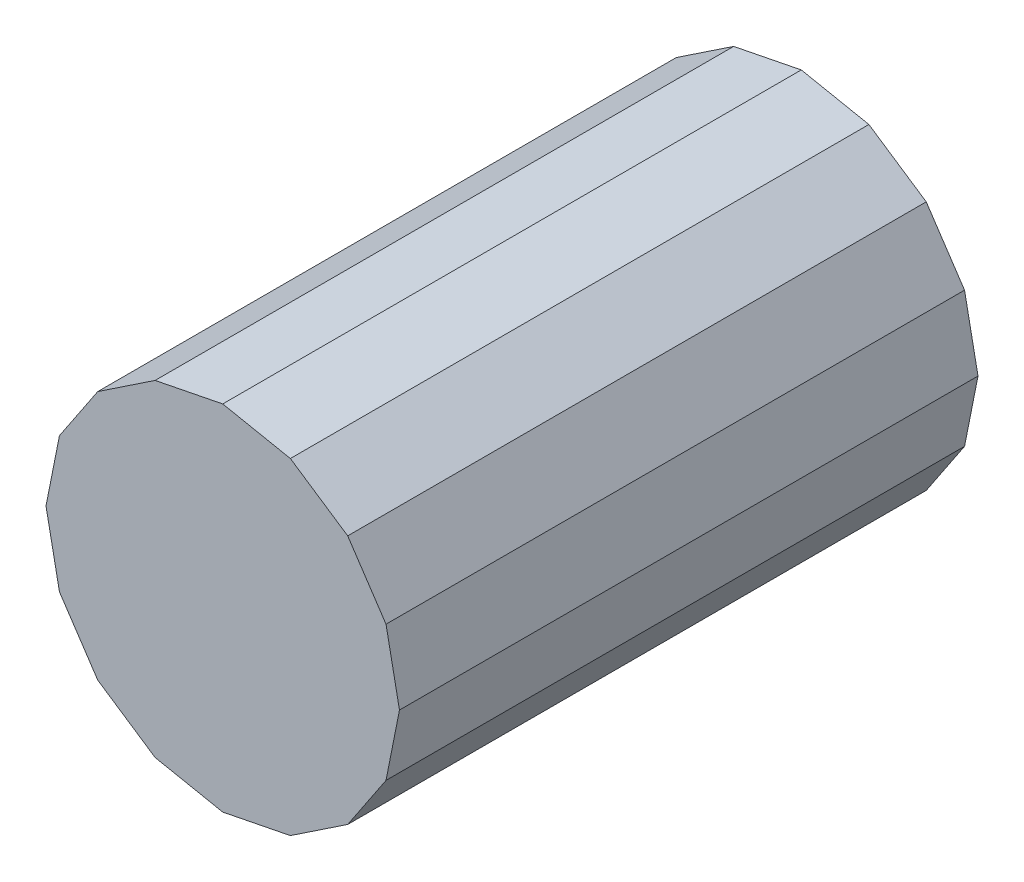
ISO-10303-21;
HEADER;
FILE_DESCRIPTION(('STEP AP214'),'2;1');
FILE_NAME('part.step','',(''),(''),'','','');
FILE_SCHEMA(('AUTOMOTIVE_DESIGN { 1 0 10303 214 1 1 1 1 }'));
ENDSEC;
DATA;
#1=APPLICATION_CONTEXT('core data for automotive mechanical design processes');
#2=APPLICATION_PROTOCOL_DEFINITION('international standard','automotive_design',2000,#1);
#3=PRODUCT_CONTEXT('',#1,'mechanical');
#4=PRODUCT('Part','Part','',(#3));
#5=PRODUCT_RELATED_PRODUCT_CATEGORY('part','',(#4));
#6=PRODUCT_DEFINITION_FORMATION('','',#4);
#7=PRODUCT_DEFINITION_CONTEXT('part definition',#1,'design');
#8=PRODUCT_DEFINITION('design','',#6,#7);
#9=PRODUCT_DEFINITION_SHAPE('','',#8);
#10=(LENGTH_UNIT() NAMED_UNIT(*) SI_UNIT(.MILLI.,.METRE.));
#11=(NAMED_UNIT(*) PLANE_ANGLE_UNIT() SI_UNIT($,.RADIAN.));
#12=(NAMED_UNIT(*) SI_UNIT($,.STERADIAN.) SOLID_ANGLE_UNIT());
#13=UNCERTAINTY_MEASURE_WITH_UNIT(LENGTH_MEASURE(1.E-05),#10,'distance_accuracy_value','');
#14=(GEOMETRIC_REPRESENTATION_CONTEXT(3) GLOBAL_UNCERTAINTY_ASSIGNED_CONTEXT((#13)) GLOBAL_UNIT_ASSIGNED_CONTEXT((#10,
#11,#12)) REPRESENTATION_CONTEXT('',''));
#15=CARTESIAN_POINT('',(0.,0.,0.));
#16=DIRECTION('',(0.,0.,1.));
#17=DIRECTION('',(1.,0.,0.));
#18=AXIS2_PLACEMENT_3D('',#15,#16,#17);
#19=CARTESIAN_POINT('',(-7.63328928000013,8.2750025,1.3499998));
#20=DIRECTION('',(0.,0.,1.));
#21=DIRECTION('',(1.,0.,0.));
#22=AXIS2_PLACEMENT_3D('',#19,#20,#21);
#23=PLANE('',#22);
#24=DIRECTION('',(0.555576860232964,0.831465184101945,0.));
#25=VECTOR('',#24,1.);
#26=CARTESIAN_POINT('',(-7.61933706000013,8.34514714,1.3499998));
#27=LINE('',#26,#25);
#28=CARTESIAN_POINT('',(-7.61933706000013,8.34514714,1.3499998));
#29=VERTEX_POINT('',#28);
#30=CARTESIAN_POINT('',(-7.57960384000013,8.40461108,1.3499998));
#31=VERTEX_POINT('',#30);
#32=EDGE_CURVE('E196',#29,#31,#27,.T.);
#33=ORIENTED_EDGE('',*,*,#32,.T.);
#34=DIRECTION('',(0.831465184101945,0.555576860232964,0.));
#35=VECTOR('',#34,1.);
#36=CARTESIAN_POINT('',(-7.57960384000013,8.40461108,1.3499998));
#37=LINE('',#36,#35);
#38=CARTESIAN_POINT('',(-7.52013990000013,8.4443443,1.3499998));
#39=VERTEX_POINT('',#38);
#40=EDGE_CURVE('E192',#31,#39,#37,.T.);
#41=ORIENTED_EDGE('',*,*,#40,.T.);
#42=DIRECTION('',(0.980786394429767,0.195084721342954,0.));
#43=VECTOR('',#42,1.);
#44=CARTESIAN_POINT('',(-7.52013990000013,8.4443443,1.3499998));
#45=LINE('',#44,#43);
#46=CARTESIAN_POINT('',(-7.44999526000013,8.45829652,1.3499998));
#47=VERTEX_POINT('',#46);
#48=EDGE_CURVE('E188',#39,#47,#45,.T.);
#49=ORIENTED_EDGE('',*,*,#48,.T.);
#50=DIRECTION('',(0.980786394429767,-0.195084721342954,0.));
#51=VECTOR('',#50,1.);
#52=CARTESIAN_POINT('',(-7.44999526000013,8.45829652,1.3499998));
#53=LINE('',#52,#51);
#54=CARTESIAN_POINT('',(-7.37985062000013,8.4443443,1.3499998));
#55=VERTEX_POINT('',#54);
#56=EDGE_CURVE('E184',#47,#55,#53,.T.);
#57=ORIENTED_EDGE('',*,*,#56,.T.);
#58=DIRECTION('',(0.831465184101945,-0.555576860232964,0.));
#59=VECTOR('',#58,1.);
#60=CARTESIAN_POINT('',(-7.37985062000013,8.4443443,1.3499998));
#61=LINE('',#60,#59);
#62=CARTESIAN_POINT('',(-7.32038668000013,8.40461108,1.3499998));
#63=VERTEX_POINT('',#62);
#64=EDGE_CURVE('E180',#55,#63,#61,.T.);
#65=ORIENTED_EDGE('',*,*,#64,.T.);
#66=DIRECTION('',(0.555576860232964,-0.831465184101945,0.));
#67=VECTOR('',#66,1.);
#68=CARTESIAN_POINT('',(-7.32038668000013,8.40461108,1.3499998));
#69=LINE('',#68,#67);
#70=CARTESIAN_POINT('',(-7.28065346000013,8.34514714,1.3499998));
#71=VERTEX_POINT('',#70);
#72=EDGE_CURVE('E176',#63,#71,#69,.T.);
#73=ORIENTED_EDGE('',*,*,#72,.T.);
#74=DIRECTION('',(0.195084721342954,-0.980786394429767,0.));
#75=VECTOR('',#74,1.);
#76=CARTESIAN_POINT('',(-7.28065346000013,8.34514714,1.3499998));
#77=LINE('',#76,#75);
#78=CARTESIAN_POINT('',(-7.26670124000013,8.2750025,1.3499998));
#79=VERTEX_POINT('',#78);
#80=EDGE_CURVE('E172',#71,#79,#77,.T.);
#81=ORIENTED_EDGE('',*,*,#80,.T.);
#82=DIRECTION('',(-0.195084721342954,-0.980786394429767,0.));
#83=VECTOR('',#82,1.);
#84=CARTESIAN_POINT('',(-7.26670124000013,8.2750025,1.3499998));
#85=LINE('',#84,#83);
#86=CARTESIAN_POINT('',(-7.28065346000013,8.20485786,1.3499998));
#87=VERTEX_POINT('',#86);
#88=EDGE_CURVE('E168',#79,#87,#85,.T.);
#89=ORIENTED_EDGE('',*,*,#88,.T.);
#90=DIRECTION('',(-0.555576860232964,-0.831465184101945,0.));
#91=VECTOR('',#90,1.);
#92=CARTESIAN_POINT('',(-7.28065346000013,8.20485786,1.3499998));
#93=LINE('',#92,#91);
#94=CARTESIAN_POINT('',(-7.32038668000013,8.14539392,1.3499998));
#95=VERTEX_POINT('',#94);
#96=EDGE_CURVE('E164',#87,#95,#93,.T.);
#97=ORIENTED_EDGE('',*,*,#96,.T.);
#98=DIRECTION('',(-0.831465184101945,-0.555576860232964,0.));
#99=VECTOR('',#98,1.);
#100=CARTESIAN_POINT('',(-7.32038668000013,8.14539392,1.3499998));
#101=LINE('',#100,#99);
#102=CARTESIAN_POINT('',(-7.37985062000013,8.1056607,1.3499998));
#103=VERTEX_POINT('',#102);
#104=EDGE_CURVE('E160',#95,#103,#101,.T.);
#105=ORIENTED_EDGE('',*,*,#104,.T.);
#106=DIRECTION('',(-0.980786394429767,-0.195084721342954,0.));
#107=VECTOR('',#106,1.);
#108=CARTESIAN_POINT('',(-7.37985062000013,8.1056607,1.3499998));
#109=LINE('',#108,#107);
#110=CARTESIAN_POINT('',(-7.44999526000013,8.09170848,1.3499998));
#111=VERTEX_POINT('',#110);
#112=EDGE_CURVE('E156',#103,#111,#109,.T.);
#113=ORIENTED_EDGE('',*,*,#112,.T.);
#114=DIRECTION('',(-0.980786394429767,0.195084721342954,0.));
#115=VECTOR('',#114,1.);
#116=CARTESIAN_POINT('',(-7.44999526000013,8.09170848,1.3499998));
#117=LINE('',#116,#115);
#118=CARTESIAN_POINT('',(-7.52013990000013,8.1056607,1.3499998));
#119=VERTEX_POINT('',#118);
#120=EDGE_CURVE('E152',#111,#119,#117,.T.);
#121=ORIENTED_EDGE('',*,*,#120,.T.);
#122=DIRECTION('',(-0.831465184101945,0.555576860232964,0.));
#123=VECTOR('',#122,1.);
#124=CARTESIAN_POINT('',(-7.52013990000013,8.1056607,1.3499998));
#125=LINE('',#124,#123);
#126=CARTESIAN_POINT('',(-7.57960384000013,8.14539392,1.3499998));
#127=VERTEX_POINT('',#126);
#128=EDGE_CURVE('E128',#119,#127,#125,.T.);
#129=ORIENTED_EDGE('',*,*,#128,.T.);
#130=DIRECTION('',(-0.555576860232964,0.831465184101945,0.));
#131=VECTOR('',#130,1.);
#132=CARTESIAN_POINT('',(-7.57960384000013,8.14539392,1.3499998));
#133=LINE('',#132,#131);
#134=CARTESIAN_POINT('',(-7.61933706000013,8.20485786,1.3499998));
#135=VERTEX_POINT('',#134);
#136=EDGE_CURVE('E130',#127,#135,#133,.T.);
#137=ORIENTED_EDGE('',*,*,#136,.T.);
#138=DIRECTION('',(-0.195084721342954,0.980786394429767,0.));
#139=VECTOR('',#138,1.);
#140=CARTESIAN_POINT('',(-7.61933706000013,8.20485786,1.3499998));
#141=LINE('',#140,#139);
#142=CARTESIAN_POINT('',(-7.63328928000014,8.2750025,1.3499998));
#143=VERTEX_POINT('',#142);
#144=EDGE_CURVE('E20',#135,#143,#141,.T.);
#145=ORIENTED_EDGE('',*,*,#144,.T.);
#146=DIRECTION('',(0.195084721342954,0.980786394429767,0.));
#147=VECTOR('',#146,1.);
#148=CARTESIAN_POINT('',(-7.63328928000013,8.2750025,1.3499998));
#149=LINE('',#148,#147);
#150=EDGE_CURVE('E201',#143,#29,#149,.T.);
#151=ORIENTED_EDGE('',*,*,#150,.T.);
#152=EDGE_LOOP('',(#33,#41,#49,#57,#65,#73,#81,#89,#97,#105,#113,#121,#129,#137,#145,#151));
#153=FACE_BOUND('',#152,.T.);
#154=ADVANCED_FACE('F17',(#153),#23,.F.);
#155=CARTESIAN_POINT('',(-7.61933706000013,8.20485786,1.95000114));
#156=DIRECTION('',(0.980786394429767,0.195084721342954,0.));
#157=DIRECTION('',(-0.195084721342954,0.980786394429767,0.));
#158=AXIS2_PLACEMENT_3D('',#155,#156,#157);
#159=PLANE('',#158);
#160=DIRECTION('',(0.,0.,1.));
#161=VECTOR('',#160,1.);
#162=CARTESIAN_POINT('',(-7.63328928000013,8.2750025,1.95000114));
#163=LINE('',#162,#161);
#164=CARTESIAN_POINT('',(-7.63328928000014,8.2750025,1.95000114));
#165=VERTEX_POINT('',#164);
#166=EDGE_CURVE('E141',#165,#143,#163,.F.);
#167=ORIENTED_EDGE('',*,*,#166,.T.);
#168=ORIENTED_EDGE('',*,*,#144,.F.);
#169=DIRECTION('',(0.,0.,1.));
#170=VECTOR('',#169,1.);
#171=CARTESIAN_POINT('',(-7.61933706000015,8.20485785999999,1.95000114));
#172=LINE('',#171,#170);
#173=CARTESIAN_POINT('',(-7.61933706000013,8.20485786,1.95000114));
#174=VERTEX_POINT('',#173);
#175=EDGE_CURVE('E136',#135,#174,#172,.T.);
#176=ORIENTED_EDGE('',*,*,#175,.T.);
#177=DIRECTION('',(0.195084721342811,-0.980786394429795,0.));
#178=VECTOR('',#177,1.);
#179=CARTESIAN_POINT('',(-7.63328928000013,8.2750025,1.95000114));
#180=LINE('',#179,#178);
#181=EDGE_CURVE('E204',#165,#174,#180,.T.);
#182=ORIENTED_EDGE('',*,*,#181,.F.);
#183=EDGE_LOOP('',(#167,#168,#176,#182));
#184=FACE_BOUND('',#183,.T.);
#185=ADVANCED_FACE('F138',(#184),#159,.F.);
#186=CARTESIAN_POINT('',(-7.57960384000013,8.14539392,1.95000114));
#187=DIRECTION('',(0.831465184101945,0.555576860232964,0.));
#188=DIRECTION('',(-0.555576860232964,0.831465184101945,0.));
#189=AXIS2_PLACEMENT_3D('',#186,#187,#188);
#190=PLANE('',#189);
#191=ORIENTED_EDGE('',*,*,#175,.F.);
#192=ORIENTED_EDGE('',*,*,#136,.F.);
#193=DIRECTION('',(0.,0.,1.));
#194=VECTOR('',#193,1.);
#195=CARTESIAN_POINT('',(-7.57960384000012,8.14539392000002,1.95000114));
#196=LINE('',#195,#194);
#197=CARTESIAN_POINT('',(-7.57960384000013,8.14539392,1.95000114));
#198=VERTEX_POINT('',#197);
#199=EDGE_CURVE('E148',#127,#198,#196,.T.);
#200=ORIENTED_EDGE('',*,*,#199,.T.);
#201=DIRECTION('',(0.55557686023274,-0.831465184102095,0.));
#202=VECTOR('',#201,1.);
#203=CARTESIAN_POINT('',(-7.61933706000013,8.20485786,1.95000114));
#204=LINE('',#203,#202);
#205=EDGE_CURVE('E145',#174,#198,#204,.T.);
#206=ORIENTED_EDGE('',*,*,#205,.F.);
#207=EDGE_LOOP('',(#191,#192,#200,#206));
#208=FACE_BOUND('',#207,.T.);
#209=ADVANCED_FACE('F143',(#208),#190,.F.);
#210=CARTESIAN_POINT('',(-7.52013990000013,8.1056607,1.95000114));
#211=DIRECTION('',(0.555576860232964,0.831465184101945,0.));
#212=DIRECTION('',(-0.831465184101945,0.555576860232964,0.));
#213=AXIS2_PLACEMENT_3D('',#210,#211,#212);
#214=PLANE('',#213);
#215=ORIENTED_EDGE('',*,*,#199,.F.);
#216=ORIENTED_EDGE('',*,*,#128,.F.);
#217=DIRECTION('',(0.,0.,1.));
#218=VECTOR('',#217,1.);
#219=CARTESIAN_POINT('',(-7.52013990000013,8.10566070000001,1.95000114));
#220=LINE('',#219,#218);
#221=CARTESIAN_POINT('',(-7.52013990000013,8.1056607,1.95000114));
#222=VERTEX_POINT('',#221);
#223=EDGE_CURVE('E154',#119,#222,#220,.T.);
#224=ORIENTED_EDGE('',*,*,#223,.T.);
#225=DIRECTION('',(0.831465184102083,-0.555576860232757,0.));
#226=VECTOR('',#225,1.);
#227=CARTESIAN_POINT('',(-7.57960384000013,8.14539392,1.95000114));
#228=LINE('',#227,#226);
#229=EDGE_CURVE('E207',#198,#222,#228,.T.);
#230=ORIENTED_EDGE('',*,*,#229,.F.);
#231=EDGE_LOOP('',(#215,#216,#224,#230));
#232=FACE_BOUND('',#231,.T.);
#233=ADVANCED_FACE('F304',(#232),#214,.F.);
#234=CARTESIAN_POINT('',(-7.44999526000013,8.09170848,1.95000114));
#235=DIRECTION('',(0.195084721342954,0.980786394429767,0.));
#236=DIRECTION('',(-0.980786394429767,0.195084721342954,0.));
#237=AXIS2_PLACEMENT_3D('',#234,#235,#236);
#238=PLANE('',#237);
#239=ORIENTED_EDGE('',*,*,#223,.F.);
#240=ORIENTED_EDGE('',*,*,#120,.F.);
#241=DIRECTION('',(0.,0.,1.));
#242=VECTOR('',#241,1.);
#243=CARTESIAN_POINT('',(-7.44999526000013,8.09170847999999,1.95000114));
#244=LINE('',#243,#242);
#245=CARTESIAN_POINT('',(-7.44999526000013,8.09170848,1.95000114));
#246=VERTEX_POINT('',#245);
#247=EDGE_CURVE('E158',#111,#246,#244,.T.);
#248=ORIENTED_EDGE('',*,*,#247,.T.);
#249=DIRECTION('',(0.980786394429796,-0.195084721342806,0.));
#250=VECTOR('',#249,1.);
#251=CARTESIAN_POINT('',(-7.52013990000013,8.1056607,1.95000114));
#252=LINE('',#251,#250);
#253=EDGE_CURVE('E210',#222,#246,#252,.T.);
#254=ORIENTED_EDGE('',*,*,#253,.F.);
#255=EDGE_LOOP('',(#239,#240,#248,#254));
#256=FACE_BOUND('',#255,.T.);
#257=ADVANCED_FACE('F302',(#256),#238,.F.);
#258=CARTESIAN_POINT('',(-7.37985062000013,8.1056607,1.95000114));
#259=DIRECTION('',(-0.195084721342954,0.980786394429767,0.));
#260=DIRECTION('',(-0.980786394429767,-0.195084721342954,0.));
#261=AXIS2_PLACEMENT_3D('',#258,#259,#260);
#262=PLANE('',#261);
#263=ORIENTED_EDGE('',*,*,#247,.F.);
#264=ORIENTED_EDGE('',*,*,#112,.F.);
#265=DIRECTION('',(0.,0.,1.));
#266=VECTOR('',#265,1.);
#267=CARTESIAN_POINT('',(-7.37985062000012,8.10566069999999,1.95000114));
#268=LINE('',#267,#266);
#269=CARTESIAN_POINT('',(-7.37985062000013,8.1056607,1.95000114));
#270=VERTEX_POINT('',#269);
#271=EDGE_CURVE('E162',#103,#270,#268,.T.);
#272=ORIENTED_EDGE('',*,*,#271,.T.);
#273=DIRECTION('',(0.980786394429796,0.195084721342806,0.));
#274=VECTOR('',#273,1.);
#275=CARTESIAN_POINT('',(-7.44999526000013,8.09170848,1.95000114));
#276=LINE('',#275,#274);
#277=EDGE_CURVE('E213',#246,#270,#276,.T.);
#278=ORIENTED_EDGE('',*,*,#277,.F.);
#279=EDGE_LOOP('',(#263,#264,#272,#278));
#280=FACE_BOUND('',#279,.T.);
#281=ADVANCED_FACE('F297',(#280),#262,.F.);
#282=CARTESIAN_POINT('',(-7.32038668000013,8.14539392,1.95000114));
#283=DIRECTION('',(-0.555576860232964,0.831465184101945,0.));
#284=DIRECTION('',(-0.831465184101945,-0.555576860232964,0.));
#285=AXIS2_PLACEMENT_3D('',#282,#283,#284);
#286=PLANE('',#285);
#287=ORIENTED_EDGE('',*,*,#271,.F.);
#288=ORIENTED_EDGE('',*,*,#104,.F.);
#289=DIRECTION('',(0.,0.,1.));
#290=VECTOR('',#289,1.);
#291=CARTESIAN_POINT('',(-7.32038668000015,8.14539392000001,1.95000114));
#292=LINE('',#291,#290);
#293=CARTESIAN_POINT('',(-7.32038668000013,8.14539392,1.95000114));
#294=VERTEX_POINT('',#293);
#295=EDGE_CURVE('E166',#95,#294,#292,.T.);
#296=ORIENTED_EDGE('',*,*,#295,.T.);
#297=DIRECTION('',(0.83146518410208,0.555576860232763,0.));
#298=VECTOR('',#297,1.);
#299=CARTESIAN_POINT('',(-7.37985062000013,8.1056607,1.95000114));
#300=LINE('',#299,#298);
#301=EDGE_CURVE('E216',#270,#294,#300,.T.);
#302=ORIENTED_EDGE('',*,*,#301,.F.);
#303=EDGE_LOOP('',(#287,#288,#296,#302));
#304=FACE_BOUND('',#303,.T.);
#305=ADVANCED_FACE('F292',(#304),#286,.F.);
#306=CARTESIAN_POINT('',(-7.28065346000013,8.20485786,1.95000114));
#307=DIRECTION('',(-0.831465184101945,0.555576860232964,0.));
#308=DIRECTION('',(-0.555576860232964,-0.831465184101945,0.));
#309=AXIS2_PLACEMENT_3D('',#306,#307,#308);
#310=PLANE('',#309);
#311=ORIENTED_EDGE('',*,*,#295,.F.);
#312=ORIENTED_EDGE('',*,*,#96,.F.);
#313=DIRECTION('',(0.,0.,1.));
#314=VECTOR('',#313,1.);
#315=CARTESIAN_POINT('',(-7.28065346000014,8.20485786,1.95000114));
#316=LINE('',#315,#314);
#317=CARTESIAN_POINT('',(-7.28065346000013,8.20485786,1.95000114));
#318=VERTEX_POINT('',#317);
#319=EDGE_CURVE('E170',#87,#318,#316,.T.);
#320=ORIENTED_EDGE('',*,*,#319,.T.);
#321=DIRECTION('',(0.555576860232749,0.831465184102089,0.));
#322=VECTOR('',#321,1.);
#323=CARTESIAN_POINT('',(-7.32038668000013,8.14539392,1.95000114));
#324=LINE('',#323,#322);
#325=EDGE_CURVE('E219',#294,#318,#324,.T.);
#326=ORIENTED_EDGE('',*,*,#325,.F.);
#327=EDGE_LOOP('',(#311,#312,#320,#326));
#328=FACE_BOUND('',#327,.T.);
#329=ADVANCED_FACE('F287',(#328),#310,.F.);
#330=CARTESIAN_POINT('',(-7.26670124000013,8.2750025,1.95000114));
#331=DIRECTION('',(-0.980786394429767,0.195084721342954,0.));
#332=DIRECTION('',(-0.195084721342954,-0.980786394429767,0.));
#333=AXIS2_PLACEMENT_3D('',#330,#331,#332);
#334=PLANE('',#333);
#335=ORIENTED_EDGE('',*,*,#319,.F.);
#336=ORIENTED_EDGE('',*,*,#88,.F.);
#337=DIRECTION('',(0.,0.,1.));
#338=VECTOR('',#337,1.);
#339=CARTESIAN_POINT('',(-7.26670124000012,8.2750025,1.95000114));
#340=LINE('',#339,#338);
#341=CARTESIAN_POINT('',(-7.26670124000013,8.2750025,1.95000114));
#342=VERTEX_POINT('',#341);
#343=EDGE_CURVE('E174',#79,#342,#340,.T.);
#344=ORIENTED_EDGE('',*,*,#343,.T.);
#345=DIRECTION('',(0.195084721342799,0.980786394429798,0.));
#346=VECTOR('',#345,1.);
#347=CARTESIAN_POINT('',(-7.28065346000013,8.20485786,1.95000114));
#348=LINE('',#347,#346);
#349=EDGE_CURVE('E222',#318,#342,#348,.T.);
#350=ORIENTED_EDGE('',*,*,#349,.F.);
#351=EDGE_LOOP('',(#335,#336,#344,#350));
#352=FACE_BOUND('',#351,.T.);
#353=ADVANCED_FACE('F282',(#352),#334,.F.);
#354=CARTESIAN_POINT('',(-7.28065346000013,8.34514714,1.95000114));
#355=DIRECTION('',(-0.980786394429767,-0.195084721342954,0.));
#356=DIRECTION('',(0.195084721342954,-0.980786394429767,0.));
#357=AXIS2_PLACEMENT_3D('',#354,#355,#356);
#358=PLANE('',#357);
#359=ORIENTED_EDGE('',*,*,#343,.F.);
#360=ORIENTED_EDGE('',*,*,#80,.F.);
#361=DIRECTION('',(0.,0.,1.));
#362=VECTOR('',#361,1.);
#363=CARTESIAN_POINT('',(-7.28065346000011,8.34514714000001,1.95000114));
#364=LINE('',#363,#362);
#365=CARTESIAN_POINT('',(-7.28065346000013,8.34514714,1.95000114));
#366=VERTEX_POINT('',#365);
#367=EDGE_CURVE('E178',#71,#366,#364,.T.);
#368=ORIENTED_EDGE('',*,*,#367,.T.);
#369=DIRECTION('',(-0.195084721342794,0.980786394429799,0.));
#370=VECTOR('',#369,1.);
#371=CARTESIAN_POINT('',(-7.26670124000013,8.2750025,1.95000114));
#372=LINE('',#371,#370);
#373=EDGE_CURVE('E225',#342,#366,#372,.T.);
#374=ORIENTED_EDGE('',*,*,#373,.F.);
#375=EDGE_LOOP('',(#359,#360,#368,#374));
#376=FACE_BOUND('',#375,.T.);
#377=ADVANCED_FACE('F277',(#376),#358,.F.);
#378=CARTESIAN_POINT('',(-7.32038668000013,8.40461108,1.95000114));
#379=DIRECTION('',(-0.831465184101945,-0.555576860232964,0.));
#380=DIRECTION('',(0.555576860232964,-0.831465184101945,0.));
#381=AXIS2_PLACEMENT_3D('',#378,#379,#380);
#382=PLANE('',#381);
#383=ORIENTED_EDGE('',*,*,#367,.F.);
#384=ORIENTED_EDGE('',*,*,#72,.F.);
#385=DIRECTION('',(0.,0.,1.));
#386=VECTOR('',#385,1.);
#387=CARTESIAN_POINT('',(-7.32038668000014,8.40461107999998,1.95000114));
#388=LINE('',#387,#386);
#389=CARTESIAN_POINT('',(-7.32038668000013,8.40461108,1.95000114));
#390=VERTEX_POINT('',#389);
#391=EDGE_CURVE('E182',#63,#390,#388,.T.);
#392=ORIENTED_EDGE('',*,*,#391,.T.);
#393=DIRECTION('',(-0.555576860232749,0.831465184102089,0.));
#394=VECTOR('',#393,1.);
#395=CARTESIAN_POINT('',(-7.28065346000013,8.34514714,1.95000114));
#396=LINE('',#395,#394);
#397=EDGE_CURVE('E228',#366,#390,#396,.T.);
#398=ORIENTED_EDGE('',*,*,#397,.F.);
#399=EDGE_LOOP('',(#383,#384,#392,#398));
#400=FACE_BOUND('',#399,.T.);
#401=ADVANCED_FACE('F272',(#400),#382,.F.);
#402=CARTESIAN_POINT('',(-7.37985062000013,8.4443443,1.95000114));
#403=DIRECTION('',(-0.555576860232964,-0.831465184101945,0.));
#404=DIRECTION('',(0.831465184101945,-0.555576860232964,0.));
#405=AXIS2_PLACEMENT_3D('',#402,#403,#404);
#406=PLANE('',#405);
#407=ORIENTED_EDGE('',*,*,#391,.F.);
#408=ORIENTED_EDGE('',*,*,#64,.F.);
#409=DIRECTION('',(0.,0.,1.));
#410=VECTOR('',#409,1.);
#411=CARTESIAN_POINT('',(-7.37985062000013,8.44434429999999,1.95000114));
#412=LINE('',#411,#410);
#413=CARTESIAN_POINT('',(-7.37985062000013,8.4443443,1.95000114));
#414=VERTEX_POINT('',#413);
#415=EDGE_CURVE('E186',#55,#414,#412,.T.);
#416=ORIENTED_EDGE('',*,*,#415,.T.);
#417=DIRECTION('',(-0.831465184102091,0.555576860232746,0.));
#418=VECTOR('',#417,1.);
#419=CARTESIAN_POINT('',(-7.32038668000013,8.40461108,1.95000114));
#420=LINE('',#419,#418);
#421=EDGE_CURVE('E231',#390,#414,#420,.T.);
#422=ORIENTED_EDGE('',*,*,#421,.F.);
#423=EDGE_LOOP('',(#407,#408,#416,#422));
#424=FACE_BOUND('',#423,.T.);
#425=ADVANCED_FACE('F267',(#424),#406,.F.);
#426=CARTESIAN_POINT('',(-7.44999526000013,8.45829652,1.95000114));
#427=DIRECTION('',(-0.195084721342954,-0.980786394429767,0.));
#428=DIRECTION('',(0.980786394429767,-0.195084721342954,0.));
#429=AXIS2_PLACEMENT_3D('',#426,#427,#428);
#430=PLANE('',#429);
#431=ORIENTED_EDGE('',*,*,#415,.F.);
#432=ORIENTED_EDGE('',*,*,#56,.F.);
#433=DIRECTION('',(0.,0.,1.));
#434=VECTOR('',#433,1.);
#435=CARTESIAN_POINT('',(-7.44999526000013,8.45829652000001,1.95000114));
#436=LINE('',#435,#434);
#437=CARTESIAN_POINT('',(-7.44999526000013,8.45829652,1.95000114));
#438=VERTEX_POINT('',#437);
#439=EDGE_CURVE('E190',#47,#438,#436,.T.);
#440=ORIENTED_EDGE('',*,*,#439,.T.);
#441=DIRECTION('',(-0.980786394429796,0.195084721342806,0.));
#442=VECTOR('',#441,1.);
#443=CARTESIAN_POINT('',(-7.37985062000013,8.4443443,1.95000114));
#444=LINE('',#443,#442);
#445=EDGE_CURVE('E234',#414,#438,#444,.T.);
#446=ORIENTED_EDGE('',*,*,#445,.F.);
#447=EDGE_LOOP('',(#431,#432,#440,#446));
#448=FACE_BOUND('',#447,.T.);
#449=ADVANCED_FACE('F262',(#448),#430,.F.);
#450=CARTESIAN_POINT('',(-7.52013990000013,8.4443443,1.95000114));
#451=DIRECTION('',(0.195084721342954,-0.980786394429767,0.));
#452=DIRECTION('',(0.980786394429767,0.195084721342954,0.));
#453=AXIS2_PLACEMENT_3D('',#450,#451,#452);
#454=PLANE('',#453);
#455=ORIENTED_EDGE('',*,*,#439,.F.);
#456=ORIENTED_EDGE('',*,*,#48,.F.);
#457=DIRECTION('',(0.,0.,1.));
#458=VECTOR('',#457,1.);
#459=CARTESIAN_POINT('',(-7.52013990000014,8.44434430000002,1.95000114));
#460=LINE('',#459,#458);
#461=CARTESIAN_POINT('',(-7.52013990000013,8.4443443,1.95000114));
#462=VERTEX_POINT('',#461);
#463=EDGE_CURVE('E194',#39,#462,#460,.T.);
#464=ORIENTED_EDGE('',*,*,#463,.T.);
#465=DIRECTION('',(-0.980786394429796,-0.195084721342806,0.));
#466=VECTOR('',#465,1.);
#467=CARTESIAN_POINT('',(-7.44999526000013,8.45829652,1.95000114));
#468=LINE('',#467,#466);
#469=EDGE_CURVE('E237',#438,#462,#468,.T.);
#470=ORIENTED_EDGE('',*,*,#469,.F.);
#471=EDGE_LOOP('',(#455,#456,#464,#470));
#472=FACE_BOUND('',#471,.T.);
#473=ADVANCED_FACE('F257',(#472),#454,.F.);
#474=CARTESIAN_POINT('',(-7.57960384000013,8.40461108,1.95000114));
#475=DIRECTION('',(0.555576860232964,-0.831465184101945,0.));
#476=DIRECTION('',(0.831465184101945,0.555576860232964,0.));
#477=AXIS2_PLACEMENT_3D('',#474,#475,#476);
#478=PLANE('',#477);
#479=ORIENTED_EDGE('',*,*,#463,.F.);
#480=ORIENTED_EDGE('',*,*,#40,.F.);
#481=DIRECTION('',(0.,0.,1.));
#482=VECTOR('',#481,1.);
#483=CARTESIAN_POINT('',(-7.57960384000012,8.40461107999999,1.95000114));
#484=LINE('',#483,#482);
#485=CARTESIAN_POINT('',(-7.57960384000013,8.40461108,1.95000114));
#486=VERTEX_POINT('',#485);
#487=EDGE_CURVE('E198',#31,#486,#484,.T.);
#488=ORIENTED_EDGE('',*,*,#487,.T.);
#489=DIRECTION('',(-0.831465184102095,-0.55557686023274,0.));
#490=VECTOR('',#489,1.);
#491=CARTESIAN_POINT('',(-7.52013990000013,8.4443443,1.95000114));
#492=LINE('',#491,#490);
#493=EDGE_CURVE('E240',#462,#486,#492,.T.);
#494=ORIENTED_EDGE('',*,*,#493,.F.);
#495=EDGE_LOOP('',(#479,#480,#488,#494));
#496=FACE_BOUND('',#495,.T.);
#497=ADVANCED_FACE('F252',(#496),#478,.F.);
#498=CARTESIAN_POINT('',(-7.61933706000013,8.34514714,1.95000114));
#499=DIRECTION('',(0.831465184101945,-0.555576860232964,0.));
#500=DIRECTION('',(0.555576860232964,0.831465184101945,0.));
#501=AXIS2_PLACEMENT_3D('',#498,#499,#500);
#502=PLANE('',#501);
#503=ORIENTED_EDGE('',*,*,#487,.F.);
#504=ORIENTED_EDGE('',*,*,#32,.F.);
#505=DIRECTION('',(0.,0.,1.));
#506=VECTOR('',#505,1.);
#507=CARTESIAN_POINT('',(-7.61933706000012,8.34514714,1.95000114));
#508=LINE('',#507,#506);
#509=CARTESIAN_POINT('',(-7.61933706000013,8.34514714,1.95000114));
#510=VERTEX_POINT('',#509);
#511=EDGE_CURVE('E35',#29,#510,#508,.T.);
#512=ORIENTED_EDGE('',*,*,#511,.T.);
#513=DIRECTION('',(-0.55557686023274,-0.831465184102095,0.));
#514=VECTOR('',#513,1.);
#515=CARTESIAN_POINT('',(-7.57960384000013,8.40461108,1.95000114));
#516=LINE('',#515,#514);
#517=EDGE_CURVE('E26',#486,#510,#516,.T.);
#518=ORIENTED_EDGE('',*,*,#517,.F.);
#519=EDGE_LOOP('',(#503,#504,#512,#518));
#520=FACE_BOUND('',#519,.T.);
#521=ADVANCED_FACE('F248',(#520),#502,.F.);
#522=CARTESIAN_POINT('',(-7.63328928000013,8.2750025,1.95000114));
#523=DIRECTION('',(0.980786394429767,-0.195084721342954,0.));
#524=DIRECTION('',(0.195084721342954,0.980786394429767,0.));
#525=AXIS2_PLACEMENT_3D('',#522,#523,#524);
#526=PLANE('',#525);
#527=ORIENTED_EDGE('',*,*,#511,.F.);
#528=ORIENTED_EDGE('',*,*,#150,.F.);
#529=ORIENTED_EDGE('',*,*,#166,.F.);
#530=DIRECTION('',(-0.195084721342806,-0.980786394429796,0.));
#531=VECTOR('',#530,1.);
#532=CARTESIAN_POINT('',(-7.61933706000013,8.34514714,1.95000114));
#533=LINE('',#532,#531);
#534=EDGE_CURVE('E11',#510,#165,#533,.T.);
#535=ORIENTED_EDGE('',*,*,#534,.F.);
#536=EDGE_LOOP('',(#527,#528,#529,#535));
#537=FACE_BOUND('',#536,.T.);
#538=ADVANCED_FACE('F307',(#537),#526,.F.);
#539=CARTESIAN_POINT('',(-7.63328928000013,8.2750025,1.95000114));
#540=DIRECTION('',(0.,0.,1.));
#541=DIRECTION('',(1.,0.,0.));
#542=AXIS2_PLACEMENT_3D('',#539,#540,#541);
#543=PLANE('',#542);
#544=ORIENTED_EDGE('',*,*,#517,.T.);
#545=ORIENTED_EDGE('',*,*,#534,.T.);
#546=ORIENTED_EDGE('',*,*,#181,.T.);
#547=ORIENTED_EDGE('',*,*,#205,.T.);
#548=ORIENTED_EDGE('',*,*,#229,.T.);
#549=ORIENTED_EDGE('',*,*,#253,.T.);
#550=ORIENTED_EDGE('',*,*,#277,.T.);
#551=ORIENTED_EDGE('',*,*,#301,.T.);
#552=ORIENTED_EDGE('',*,*,#325,.T.);
#553=ORIENTED_EDGE('',*,*,#349,.T.);
#554=ORIENTED_EDGE('',*,*,#373,.T.);
#555=ORIENTED_EDGE('',*,*,#397,.T.);
#556=ORIENTED_EDGE('',*,*,#421,.T.);
#557=ORIENTED_EDGE('',*,*,#445,.T.);
#558=ORIENTED_EDGE('',*,*,#469,.T.);
#559=ORIENTED_EDGE('',*,*,#493,.T.);
#560=EDGE_LOOP('',(#544,#545,#546,#547,#548,#549,#550,#551,#552,#553,#554,#555,#556,#557,#558,#559));
#561=FACE_BOUND('',#560,.T.);
#562=ADVANCED_FACE('F245',(#561),#543,.T.);
#563=CLOSED_SHELL('',(#154,#185,#209,#233,#257,#281,#305,#329,#353,#377,#401,#425,#449,#473,
#497,#521,#538,#562));
#564=MANIFOLD_SOLID_BREP('B1',#563);
#565=ADVANCED_BREP_SHAPE_REPRESENTATION('',(#18,#564),#14);
#566=SHAPE_DEFINITION_REPRESENTATION(#9,#565);
ENDSEC;
END-ISO-10303-21;
